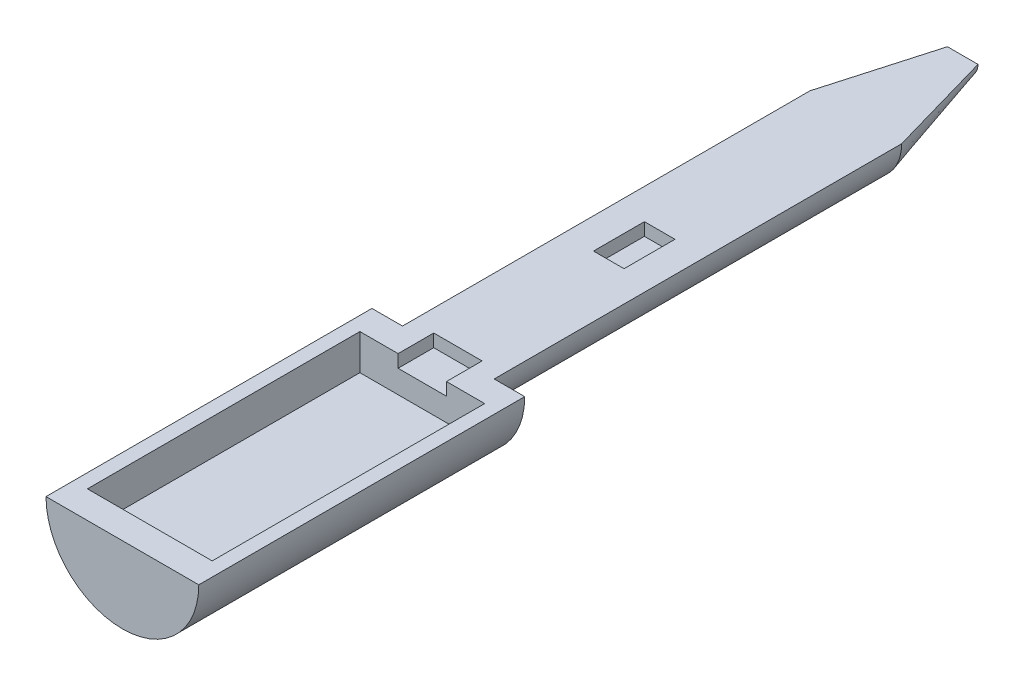
ISO-10303-21;
HEADER;
FILE_DESCRIPTION(('STEP AP214'),'2;1');
FILE_NAME('part.step','',(''),(''),'','','');
FILE_SCHEMA(('AUTOMOTIVE_DESIGN { 1 0 10303 214 1 1 1 1 }'));
ENDSEC;
DATA;
#1=APPLICATION_CONTEXT('core data for automotive mechanical design processes');
#2=APPLICATION_PROTOCOL_DEFINITION('international standard','automotive_design',2000,#1);
#3=PRODUCT_CONTEXT('',#1,'mechanical');
#4=PRODUCT('Part','Part','',(#3));
#5=PRODUCT_RELATED_PRODUCT_CATEGORY('part','',(#4));
#6=PRODUCT_DEFINITION_FORMATION('','',#4);
#7=PRODUCT_DEFINITION_CONTEXT('part definition',#1,'design');
#8=PRODUCT_DEFINITION('design','',#6,#7);
#9=PRODUCT_DEFINITION_SHAPE('','',#8);
#10=(LENGTH_UNIT() NAMED_UNIT(*) SI_UNIT(.MILLI.,.METRE.));
#11=(NAMED_UNIT(*) PLANE_ANGLE_UNIT() SI_UNIT($,.RADIAN.));
#12=(NAMED_UNIT(*) SI_UNIT($,.STERADIAN.) SOLID_ANGLE_UNIT());
#13=UNCERTAINTY_MEASURE_WITH_UNIT(LENGTH_MEASURE(1.E-05),#10,'distance_accuracy_value','');
#14=(GEOMETRIC_REPRESENTATION_CONTEXT(3) GLOBAL_UNCERTAINTY_ASSIGNED_CONTEXT((#13)) GLOBAL_UNIT_ASSIGNED_CONTEXT((#10,
#11,#12)) REPRESENTATION_CONTEXT('',''));
#15=CARTESIAN_POINT('',(0.,0.,0.));
#16=DIRECTION('',(0.,0.,1.));
#17=DIRECTION('',(1.,0.,0.));
#18=AXIS2_PLACEMENT_3D('',#15,#16,#17);
#19=CARTESIAN_POINT('',(0.,0.,0.));
#20=DIRECTION('',(0.,0.,1.));
#21=DIRECTION('',(1.,0.,0.));
#22=AXIS2_PLACEMENT_3D('',#19,#20,#21);
#23=PLANE('',#22);
#24=CARTESIAN_POINT('',(0.,0.,0.));
#25=DIRECTION('',(0.,0.,-1.));
#26=DIRECTION('',(-1.,0.,0.));
#27=AXIS2_PLACEMENT_3D('',#24,#25,#26);
#28=CIRCLE('',#27,15.);
#29=CARTESIAN_POINT('',(15.,1.04744440165294E-13,0.));
#30=VERTEX_POINT('',#29);
#31=CARTESIAN_POINT('',(-15.,0.,0.));
#32=VERTEX_POINT('',#31);
#33=EDGE_CURVE('E11',#30,#32,#28,.T.);
#34=ORIENTED_EDGE('',*,*,#33,.F.);
#35=DIRECTION('',(-1.,0.,0.));
#36=VECTOR('',#35,1.);
#37=CARTESIAN_POINT('',(0.,0.,0.));
#38=LINE('',#37,#36);
#39=EDGE_CURVE('E331',#30,#32,#38,.T.);
#40=ORIENTED_EDGE('',*,*,#39,.T.);
#41=EDGE_LOOP('',(#34,#40));
#42=FACE_BOUND('',#41,.T.);
#43=ADVANCED_FACE('F42',(#42),#23,.T.);
#44=CARTESIAN_POINT('',(0.,0.,-165.));
#45=DIRECTION('',(0.,0.,-1.));
#46=DIRECTION('',(-1.,0.,0.));
#47=AXIS2_PLACEMENT_3D('',#44,#45,#46);
#48=CYLINDRICAL_SURFACE('',#47,15.);
#49=CARTESIAN_POINT('',(0.,0.,-64.));
#50=DIRECTION('',(0.,0.,-1.));
#51=DIRECTION('',(-1.,0.,0.));
#52=AXIS2_PLACEMENT_3D('',#49,#50,#51);
#53=CIRCLE('',#52,15.);
#54=CARTESIAN_POINT('',(15.,1.04744440165294E-13,-64.));
#55=VERTEX_POINT('',#54);
#56=CARTESIAN_POINT('',(-15.,0.,-64.));
#57=VERTEX_POINT('',#56);
#58=EDGE_CURVE('E50',#55,#57,#53,.T.);
#59=ORIENTED_EDGE('',*,*,#58,.F.);
#60=DIRECTION('',(0.,0.,1.));
#61=VECTOR('',#60,1.);
#62=CARTESIAN_POINT('',(15.,1.04744440165294E-13,0.));
#63=LINE('',#62,#61);
#64=EDGE_CURVE('E327',#55,#30,#63,.T.);
#65=ORIENTED_EDGE('',*,*,#64,.T.);
#66=ORIENTED_EDGE('',*,*,#33,.T.);
#67=DIRECTION('',(0.,0.,1.));
#68=VECTOR('',#67,1.);
#69=CARTESIAN_POINT('',(-15.,0.,0.));
#70=LINE('',#69,#68);
#71=EDGE_CURVE('E307',#57,#32,#70,.T.);
#72=ORIENTED_EDGE('',*,*,#71,.F.);
#73=EDGE_LOOP('',(#59,#65,#66,#72));
#74=FACE_BOUND('',#73,.T.);
#75=ADVANCED_FACE('F355',(#74),#48,.T.);
#76=CARTESIAN_POINT('',(15.,1.04744440165294E-13,-64.));
#77=DIRECTION('',(0.,0.,-1.));
#78=DIRECTION('',(-1.,0.,0.));
#79=AXIS2_PLACEMENT_3D('',#76,#77,#78);
#80=PLANE('',#79);
#81=CARTESIAN_POINT('',(0.,0.,-64.));
#82=DIRECTION('',(0.,0.,-1.));
#83=DIRECTION('',(-1.,0.,0.));
#84=AXIS2_PLACEMENT_3D('',#81,#82,#83);
#85=CIRCLE('',#84,8.99999999999999);
#86=CARTESIAN_POINT('',(8.99999999999999,0.,-64.));
#87=VERTEX_POINT('',#86);
#88=CARTESIAN_POINT('',(-8.99999999999999,0.,-64.));
#89=VERTEX_POINT('',#88);
#90=EDGE_CURVE('E341',#87,#89,#85,.T.);
#91=ORIENTED_EDGE('',*,*,#90,.F.);
#92=DIRECTION('',(1.,0.,0.));
#93=VECTOR('',#92,1.);
#94=CARTESIAN_POINT('',(15.,1.04744440165294E-13,-64.));
#95=LINE('',#94,#93);
#96=EDGE_CURVE('E323',#87,#55,#95,.T.);
#97=ORIENTED_EDGE('',*,*,#96,.T.);
#98=ORIENTED_EDGE('',*,*,#58,.T.);
#99=DIRECTION('',(-1.,0.,0.));
#100=VECTOR('',#99,1.);
#101=CARTESIAN_POINT('',(-15.,0.,-64.));
#102=LINE('',#101,#100);
#103=EDGE_CURVE('E303',#89,#57,#102,.T.);
#104=ORIENTED_EDGE('',*,*,#103,.F.);
#105=EDGE_LOOP('',(#91,#97,#98,#104));
#106=FACE_BOUND('',#105,.T.);
#107=ADVANCED_FACE('F346',(#106),#80,.T.);
#108=CARTESIAN_POINT('',(0.,0.,-165.));
#109=DIRECTION('',(0.,0.,-1.));
#110=DIRECTION('',(-1.,0.,0.));
#111=AXIS2_PLACEMENT_3D('',#108,#109,#110);
#112=CYLINDRICAL_SURFACE('',#111,8.99999999999999);
#113=CARTESIAN_POINT('',(0.,0.,-144.));
#114=DIRECTION('',(0.,0.,-1.));
#115=DIRECTION('',(-1.,0.,0.));
#116=AXIS2_PLACEMENT_3D('',#113,#114,#115);
#117=CIRCLE('',#116,8.99999999999999);
#118=CARTESIAN_POINT('',(8.99999999999999,0.,-144.));
#119=VERTEX_POINT('',#118);
#120=CARTESIAN_POINT('',(-8.99999999999999,0.,-144.));
#121=VERTEX_POINT('',#120);
#122=EDGE_CURVE('E338',#119,#121,#117,.T.);
#123=ORIENTED_EDGE('',*,*,#122,.F.);
#124=DIRECTION('',(0.,0.,1.));
#125=VECTOR('',#124,1.);
#126=CARTESIAN_POINT('',(8.99999999999999,0.,-64.));
#127=LINE('',#126,#125);
#128=EDGE_CURVE('E319',#119,#87,#127,.T.);
#129=ORIENTED_EDGE('',*,*,#128,.T.);
#130=ORIENTED_EDGE('',*,*,#90,.T.);
#131=DIRECTION('',(0.,0.,1.));
#132=VECTOR('',#131,1.);
#133=CARTESIAN_POINT('',(-8.99999999999999,0.,-64.));
#134=LINE('',#133,#132);
#135=EDGE_CURVE('E299',#121,#89,#134,.T.);
#136=ORIENTED_EDGE('',*,*,#135,.F.);
#137=EDGE_LOOP('',(#123,#129,#130,#136));
#138=FACE_BOUND('',#137,.T.);
#139=ADVANCED_FACE('F360',(#138),#112,.T.);
#140=CARTESIAN_POINT('',(0.,0.,-165.));
#141=DIRECTION('',(0.,0.,1.));
#142=DIRECTION('',(1.,0.,0.));
#143=AXIS2_PLACEMENT_3D('',#140,#141,#142);
#144=CONICAL_SURFACE('',#143,3.,0.278299659005111);
#145=CARTESIAN_POINT('',(0.,0.,-165.));
#146=DIRECTION('',(0.,0.,-1.));
#147=DIRECTION('',(-1.,0.,0.));
#148=AXIS2_PLACEMENT_3D('',#145,#146,#147);
#149=CIRCLE('',#148,3.);
#150=CARTESIAN_POINT('',(3.,0.,-165.));
#151=VERTEX_POINT('',#150);
#152=CARTESIAN_POINT('',(-3.,0.,-165.));
#153=VERTEX_POINT('',#152);
#154=EDGE_CURVE('E334',#151,#153,#149,.T.);
#155=ORIENTED_EDGE('',*,*,#154,.F.);
#156=DIRECTION('',(0.274721127897378,0.,0.961523947640823));
#157=VECTOR('',#156,1.);
#158=CARTESIAN_POINT('',(8.99999999999999,0.,-144.));
#159=LINE('',#158,#157);
#160=EDGE_CURVE('E315',#151,#119,#159,.T.);
#161=ORIENTED_EDGE('',*,*,#160,.T.);
#162=ORIENTED_EDGE('',*,*,#122,.T.);
#163=DIRECTION('',(-0.274721127897378,0.,0.961523947640823));
#164=VECTOR('',#163,1.);
#165=CARTESIAN_POINT('',(-8.99999999999999,0.,-144.));
#166=LINE('',#165,#164);
#167=EDGE_CURVE('E286',#153,#121,#166,.T.);
#168=ORIENTED_EDGE('',*,*,#167,.F.);
#169=EDGE_LOOP('',(#155,#161,#162,#168));
#170=FACE_BOUND('',#169,.T.);
#171=ADVANCED_FACE('F363',(#170),#144,.T.);
#172=CARTESIAN_POINT('',(3.,0.,-165.));
#173=DIRECTION('',(0.,0.,-1.));
#174=DIRECTION('',(-1.,0.,0.));
#175=AXIS2_PLACEMENT_3D('',#172,#173,#174);
#176=PLANE('',#175);
#177=DIRECTION('',(1.,0.,0.));
#178=VECTOR('',#177,1.);
#179=CARTESIAN_POINT('',(3.,0.,-165.));
#180=LINE('',#179,#178);
#181=EDGE_CURVE('E311',#153,#151,#180,.T.);
#182=ORIENTED_EDGE('',*,*,#181,.T.);
#183=ORIENTED_EDGE('',*,*,#154,.T.);
#184=EDGE_LOOP('',(#182,#183));
#185=FACE_BOUND('',#184,.T.);
#186=ADVANCED_FACE('F365',(#185),#176,.T.);
#187=CARTESIAN_POINT('',(0.,0.,0.));
#188=DIRECTION('',(0.,1.,0.));
#189=DIRECTION('',(0.,0.,-1.));
#190=AXIS2_PLACEMENT_3D('',#187,#188,#189);
#191=PLANE('',#190);
#192=DIRECTION('',(0.,0.,1.));
#193=VECTOR('',#192,1.);
#194=CARTESIAN_POINT('',(-3.,0.,-105.5));
#195=LINE('',#194,#193);
#196=CARTESIAN_POINT('',(-3.,0.,-105.5));
#197=VERTEX_POINT('',#196);
#198=CARTESIAN_POINT('',(-3.,0.,-95.5));
#199=VERTEX_POINT('',#198);
#200=EDGE_CURVE('E57',#197,#199,#195,.T.);
#201=ORIENTED_EDGE('',*,*,#200,.F.);
#202=DIRECTION('',(-1.,0.,0.));
#203=VECTOR('',#202,1.);
#204=CARTESIAN_POINT('',(-3.,0.,-105.5));
#205=LINE('',#204,#203);
#206=CARTESIAN_POINT('',(3.,0.,-105.5));
#207=VERTEX_POINT('',#206);
#208=EDGE_CURVE('E186',#207,#197,#205,.T.);
#209=ORIENTED_EDGE('',*,*,#208,.F.);
#210=DIRECTION('',(0.,0.,-1.));
#211=VECTOR('',#210,1.);
#212=CARTESIAN_POINT('',(3.,0.,-105.5));
#213=LINE('',#212,#211);
#214=CARTESIAN_POINT('',(3.,0.,-95.5));
#215=VERTEX_POINT('',#214);
#216=EDGE_CURVE('E190',#215,#207,#213,.T.);
#217=ORIENTED_EDGE('',*,*,#216,.F.);
#218=DIRECTION('',(1.,0.,0.));
#219=VECTOR('',#218,1.);
#220=CARTESIAN_POINT('',(-3.,0.,-95.5));
#221=LINE('',#220,#219);
#222=EDGE_CURVE('E199',#199,#215,#221,.T.);
#223=ORIENTED_EDGE('',*,*,#222,.F.);
#224=EDGE_LOOP('',(#201,#209,#217,#223));
#225=FACE_BOUND('',#224,.T.);
#226=DIRECTION('',(0.,0.,1.));
#227=VECTOR('',#226,1.);
#228=CARTESIAN_POINT('',(-4.75,0.,-58.8824675416096));
#229=LINE('',#228,#227);
#230=CARTESIAN_POINT('',(-4.75,0.,-65.8824675416096));
#231=VERTEX_POINT('',#230);
#232=CARTESIAN_POINT('',(-4.75,0.,-58.8824675416096));
#233=VERTEX_POINT('',#232);
#234=EDGE_CURVE('E218',#231,#233,#229,.T.);
#235=ORIENTED_EDGE('',*,*,#234,.F.);
#236=DIRECTION('',(-1.,0.,0.));
#237=VECTOR('',#236,1.);
#238=CARTESIAN_POINT('',(-4.75,0.,-65.8824675416096));
#239=LINE('',#238,#237);
#240=CARTESIAN_POINT('',(4.75,0.,-65.8824675416096));
#241=VERTEX_POINT('',#240);
#242=EDGE_CURVE('E231',#241,#231,#239,.T.);
#243=ORIENTED_EDGE('',*,*,#242,.F.);
#244=DIRECTION('',(0.,0.,-1.));
#245=VECTOR('',#244,1.);
#246=CARTESIAN_POINT('',(4.75,0.,-65.8824675416096));
#247=LINE('',#246,#245);
#248=CARTESIAN_POINT('',(4.75,0.,-58.8824675416096));
#249=VERTEX_POINT('',#248);
#250=EDGE_CURVE('E208',#249,#241,#247,.T.);
#251=ORIENTED_EDGE('',*,*,#250,.F.);
#252=DIRECTION('',(-1.,0.,0.));
#253=VECTOR('',#252,1.);
#254=CARTESIAN_POINT('',(12.25,0.,-58.8824675416096));
#255=LINE('',#254,#253);
#256=CARTESIAN_POINT('',(12.25,0.,-58.8824675416096));
#257=VERTEX_POINT('',#256);
#258=EDGE_CURVE('E255',#257,#249,#255,.T.);
#259=ORIENTED_EDGE('',*,*,#258,.F.);
#260=DIRECTION('',(0.,0.,-1.));
#261=VECTOR('',#260,1.);
#262=CARTESIAN_POINT('',(12.25,0.,-5.38246754160956));
#263=LINE('',#262,#261);
#264=CARTESIAN_POINT('',(12.25,0.,-5.38246754160956));
#265=VERTEX_POINT('',#264);
#266=EDGE_CURVE('E274',#265,#257,#263,.T.);
#267=ORIENTED_EDGE('',*,*,#266,.F.);
#268=DIRECTION('',(1.,0.,0.));
#269=VECTOR('',#268,1.);
#270=CARTESIAN_POINT('',(-12.25,0.,-5.38246754160956));
#271=LINE('',#270,#269);
#272=CARTESIAN_POINT('',(-12.25,0.,-5.38246754160956));
#273=VERTEX_POINT('',#272);
#274=EDGE_CURVE('E270',#273,#265,#271,.T.);
#275=ORIENTED_EDGE('',*,*,#274,.F.);
#276=DIRECTION('',(0.,0.,1.));
#277=VECTOR('',#276,1.);
#278=CARTESIAN_POINT('',(-12.25,0.,-58.8824675416096));
#279=LINE('',#278,#277);
#280=CARTESIAN_POINT('',(-12.25,0.,-58.8824675416096));
#281=VERTEX_POINT('',#280);
#282=EDGE_CURVE('E241',#281,#273,#279,.T.);
#283=ORIENTED_EDGE('',*,*,#282,.F.);
#284=EDGE_CURVE('E278',#233,#281,#255,.T.);
#285=ORIENTED_EDGE('',*,*,#284,.F.);
#286=EDGE_LOOP('',(#235,#243,#251,#259,#267,#275,#283,#285));
#287=FACE_BOUND('',#286,.T.);
#288=ORIENTED_EDGE('',*,*,#181,.F.);
#289=ORIENTED_EDGE('',*,*,#167,.T.);
#290=ORIENTED_EDGE('',*,*,#135,.T.);
#291=ORIENTED_EDGE('',*,*,#103,.T.);
#292=ORIENTED_EDGE('',*,*,#71,.T.);
#293=ORIENTED_EDGE('',*,*,#39,.F.);
#294=ORIENTED_EDGE('',*,*,#64,.F.);
#295=ORIENTED_EDGE('',*,*,#96,.F.);
#296=ORIENTED_EDGE('',*,*,#128,.F.);
#297=ORIENTED_EDGE('',*,*,#160,.F.);
#298=EDGE_LOOP('',(#288,#289,#290,#291,#292,#293,#294,#295,#296,#297));
#299=FACE_BOUND('',#298,.T.);
#300=ADVANCED_FACE('F352',(#225,#287,#299),#191,.T.);
#301=CARTESIAN_POINT('',(-12.25,-7.00000000000009,-58.8824675416096));
#302=DIRECTION('',(-1.,0.,0.));
#303=DIRECTION('',(0.,-1.,0.));
#304=AXIS2_PLACEMENT_3D('',#301,#302,#303);
#305=PLANE('',#304);
#306=ORIENTED_EDGE('',*,*,#282,.T.);
#307=DIRECTION('',(0.,1.,0.));
#308=VECTOR('',#307,1.);
#309=CARTESIAN_POINT('',(-12.25,-7.00000000000009,-5.38246754160956));
#310=LINE('',#309,#308);
#311=CARTESIAN_POINT('',(-12.25,-7.00000000000009,-5.38246754160956));
#312=VERTEX_POINT('',#311);
#313=EDGE_CURVE('E267',#312,#273,#310,.T.);
#314=ORIENTED_EDGE('',*,*,#313,.F.);
#315=DIRECTION('',(0.,0.,1.));
#316=VECTOR('',#315,1.);
#317=CARTESIAN_POINT('',(-12.25,-7.00000000000009,-58.8824675416096));
#318=LINE('',#317,#316);
#319=CARTESIAN_POINT('',(-12.25,-7.00000000000009,-58.8824675416096));
#320=VERTEX_POINT('',#319);
#321=EDGE_CURVE('E250',#320,#312,#318,.T.);
#322=ORIENTED_EDGE('',*,*,#321,.F.);
#323=DIRECTION('',(0.,1.,0.));
#324=VECTOR('',#323,1.);
#325=CARTESIAN_POINT('',(-12.25,-7.00000000000009,-58.8824675416096));
#326=LINE('',#325,#324);
#327=EDGE_CURVE('E282',#320,#281,#326,.T.);
#328=ORIENTED_EDGE('',*,*,#327,.T.);
#329=EDGE_LOOP('',(#306,#314,#322,#328));
#330=FACE_BOUND('',#329,.T.);
#331=ADVANCED_FACE('F372',(#330),#305,.F.);
#332=CARTESIAN_POINT('',(12.2500000000001,-6.99999999999991,-58.8824675416096));
#333=DIRECTION('',(0.,0.,-1.));
#334=DIRECTION('',(0.,1.,0.));
#335=AXIS2_PLACEMENT_3D('',#332,#333,#334);
#336=PLANE('',#335);
#337=DIRECTION('',(1.,0.,0.));
#338=VECTOR('',#337,1.);
#339=CARTESIAN_POINT('',(4.75000000000002,-2.49999999999997,-58.8824675416096));
#340=LINE('',#339,#338);
#341=CARTESIAN_POINT('',(-4.74999999999998,-2.50000000000003,-58.8824675416096));
#342=VERTEX_POINT('',#341);
#343=CARTESIAN_POINT('',(4.75000000000002,-2.49999999999997,-58.8824675416096));
#344=VERTEX_POINT('',#343);
#345=EDGE_CURVE('E214',#342,#344,#340,.T.);
#346=ORIENTED_EDGE('',*,*,#345,.F.);
#347=DIRECTION('',(0.,1.,0.));
#348=VECTOR('',#347,1.);
#349=CARTESIAN_POINT('',(-4.74999999999998,-2.50000000000003,-58.8824675416096));
#350=LINE('',#349,#348);
#351=EDGE_CURVE('E237',#342,#233,#350,.T.);
#352=ORIENTED_EDGE('',*,*,#351,.T.);
#353=ORIENTED_EDGE('',*,*,#284,.T.);
#354=ORIENTED_EDGE('',*,*,#327,.F.);
#355=DIRECTION('',(-1.,0.,0.));
#356=VECTOR('',#355,1.);
#357=CARTESIAN_POINT('',(12.2500000000001,-6.99999999999991,-58.8824675416096));
#358=LINE('',#357,#356);
#359=CARTESIAN_POINT('',(12.2500000000001,-6.99999999999991,-58.8824675416096));
#360=VERTEX_POINT('',#359);
#361=EDGE_CURVE('E263',#360,#320,#358,.T.);
#362=ORIENTED_EDGE('',*,*,#361,.F.);
#363=DIRECTION('',(0.,1.,0.));
#364=VECTOR('',#363,1.);
#365=CARTESIAN_POINT('',(12.2500000000001,-6.99999999999991,-58.8824675416096));
#366=LINE('',#365,#364);
#367=EDGE_CURVE('E287',#360,#257,#366,.T.);
#368=ORIENTED_EDGE('',*,*,#367,.T.);
#369=ORIENTED_EDGE('',*,*,#258,.T.);
#370=DIRECTION('',(0.,1.,0.));
#371=VECTOR('',#370,1.);
#372=CARTESIAN_POINT('',(4.75000000000002,-2.49999999999997,-58.8824675416096));
#373=LINE('',#372,#371);
#374=EDGE_CURVE('E227',#344,#249,#373,.T.);
#375=ORIENTED_EDGE('',*,*,#374,.F.);
#376=EDGE_LOOP('',(#346,#352,#353,#354,#362,#368,#369,#375));
#377=FACE_BOUND('',#376,.T.);
#378=ADVANCED_FACE('F410',(#377),#336,.F.);
#379=CARTESIAN_POINT('',(12.25,-6.99999999999991,-5.38246754160956));
#380=DIRECTION('',(1.,0.,0.));
#381=DIRECTION('',(0.,1.,0.));
#382=AXIS2_PLACEMENT_3D('',#379,#380,#381);
#383=PLANE('',#382);
#384=ORIENTED_EDGE('',*,*,#266,.T.);
#385=ORIENTED_EDGE('',*,*,#367,.F.);
#386=DIRECTION('',(0.,0.,-1.));
#387=VECTOR('',#386,1.);
#388=CARTESIAN_POINT('',(12.25,-6.99999999999991,-5.38246754160956));
#389=LINE('',#388,#387);
#390=CARTESIAN_POINT('',(12.25,-6.99999999999991,-5.38246754160956));
#391=VERTEX_POINT('',#390);
#392=EDGE_CURVE('E259',#391,#360,#389,.T.);
#393=ORIENTED_EDGE('',*,*,#392,.F.);
#394=DIRECTION('',(0.,1.,0.));
#395=VECTOR('',#394,1.);
#396=CARTESIAN_POINT('',(12.25,-6.99999999999991,-5.38246754160956));
#397=LINE('',#396,#395);
#398=EDGE_CURVE('E290',#391,#265,#397,.T.);
#399=ORIENTED_EDGE('',*,*,#398,.T.);
#400=EDGE_LOOP('',(#384,#385,#393,#399));
#401=FACE_BOUND('',#400,.T.);
#402=ADVANCED_FACE('F420',(#401),#383,.F.);
#403=CARTESIAN_POINT('',(-12.25,-7.00000000000009,-5.38246754160956));
#404=DIRECTION('',(0.,0.,1.));
#405=DIRECTION('',(0.,-1.,0.));
#406=AXIS2_PLACEMENT_3D('',#403,#404,#405);
#407=PLANE('',#406);
#408=ORIENTED_EDGE('',*,*,#274,.T.);
#409=ORIENTED_EDGE('',*,*,#398,.F.);
#410=DIRECTION('',(1.,0.,0.));
#411=VECTOR('',#410,1.);
#412=CARTESIAN_POINT('',(-12.25,-7.00000000000009,-5.38246754160956));
#413=LINE('',#412,#411);
#414=EDGE_CURVE('E254',#312,#391,#413,.T.);
#415=ORIENTED_EDGE('',*,*,#414,.F.);
#416=ORIENTED_EDGE('',*,*,#313,.T.);
#417=EDGE_LOOP('',(#408,#409,#415,#416));
#418=FACE_BOUND('',#417,.T.);
#419=ADVANCED_FACE('F425',(#418),#407,.F.);
#420=CARTESIAN_POINT('',(0.,-7.,0.));
#421=DIRECTION('',(0.,1.,0.));
#422=DIRECTION('',(-1.,0.,0.));
#423=AXIS2_PLACEMENT_3D('',#420,#421,#422);
#424=PLANE('',#423);
#425=ORIENTED_EDGE('',*,*,#321,.T.);
#426=ORIENTED_EDGE('',*,*,#414,.T.);
#427=ORIENTED_EDGE('',*,*,#392,.T.);
#428=ORIENTED_EDGE('',*,*,#361,.T.);
#429=EDGE_LOOP('',(#425,#426,#427,#428));
#430=FACE_BOUND('',#429,.T.);
#431=ADVANCED_FACE('F436',(#430),#424,.T.);
#432=CARTESIAN_POINT('',(-4.74999999999998,-2.50000000000003,-58.8824675416096));
#433=DIRECTION('',(-1.,0.,0.));
#434=DIRECTION('',(0.,-1.,0.));
#435=AXIS2_PLACEMENT_3D('',#432,#433,#434);
#436=PLANE('',#435);
#437=ORIENTED_EDGE('',*,*,#234,.T.);
#438=ORIENTED_EDGE('',*,*,#351,.F.);
#439=DIRECTION('',(0.,0.,1.));
#440=VECTOR('',#439,1.);
#441=CARTESIAN_POINT('',(-4.74999999999998,-2.50000000000003,-58.8824675416096));
#442=LINE('',#441,#440);
#443=CARTESIAN_POINT('',(-4.74999999999998,-2.50000000000003,-65.8824675416096));
#444=VERTEX_POINT('',#443);
#445=EDGE_CURVE('E65',#444,#342,#442,.T.);
#446=ORIENTED_EDGE('',*,*,#445,.F.);
#447=DIRECTION('',(0.,1.,0.));
#448=VECTOR('',#447,1.);
#449=CARTESIAN_POINT('',(-4.74999999999998,-2.50000000000003,-65.8824675416096));
#450=LINE('',#449,#448);
#451=EDGE_CURVE('E242',#444,#231,#450,.T.);
#452=ORIENTED_EDGE('',*,*,#451,.T.);
#453=EDGE_LOOP('',(#437,#438,#446,#452));
#454=FACE_BOUND('',#453,.T.);
#455=ADVANCED_FACE('F447',(#454),#436,.F.);
#456=CARTESIAN_POINT('',(-4.74999999999998,-2.50000000000003,-65.8824675416096));
#457=DIRECTION('',(0.,0.,-1.));
#458=DIRECTION('',(-1.,0.,0.));
#459=AXIS2_PLACEMENT_3D('',#456,#457,#458);
#460=PLANE('',#459);
#461=ORIENTED_EDGE('',*,*,#242,.T.);
#462=ORIENTED_EDGE('',*,*,#451,.F.);
#463=DIRECTION('',(-1.,0.,0.));
#464=VECTOR('',#463,1.);
#465=CARTESIAN_POINT('',(-4.74999999999998,-2.50000000000003,-65.8824675416096));
#466=LINE('',#465,#464);
#467=CARTESIAN_POINT('',(4.75000000000002,-2.49999999999997,-65.8824675416096));
#468=VERTEX_POINT('',#467);
#469=EDGE_CURVE('E222',#468,#444,#466,.T.);
#470=ORIENTED_EDGE('',*,*,#469,.F.);
#471=DIRECTION('',(0.,1.,0.));
#472=VECTOR('',#471,1.);
#473=CARTESIAN_POINT('',(4.75000000000002,-2.49999999999997,-65.8824675416096));
#474=LINE('',#473,#472);
#475=EDGE_CURVE('E245',#468,#241,#474,.T.);
#476=ORIENTED_EDGE('',*,*,#475,.T.);
#477=EDGE_LOOP('',(#461,#462,#470,#476));
#478=FACE_BOUND('',#477,.T.);
#479=ADVANCED_FACE('F466',(#478),#460,.F.);
#480=CARTESIAN_POINT('',(4.75000000000002,-2.49999999999997,-65.8824675416096));
#481=DIRECTION('',(1.,0.,0.));
#482=DIRECTION('',(0.,1.,0.));
#483=AXIS2_PLACEMENT_3D('',#480,#481,#482);
#484=PLANE('',#483);
#485=ORIENTED_EDGE('',*,*,#250,.T.);
#486=ORIENTED_EDGE('',*,*,#475,.F.);
#487=DIRECTION('',(0.,0.,-1.));
#488=VECTOR('',#487,1.);
#489=CARTESIAN_POINT('',(4.75000000000002,-2.49999999999997,-65.8824675416096));
#490=LINE('',#489,#488);
#491=EDGE_CURVE('E217',#344,#468,#490,.T.);
#492=ORIENTED_EDGE('',*,*,#491,.F.);
#493=ORIENTED_EDGE('',*,*,#374,.T.);
#494=EDGE_LOOP('',(#485,#486,#492,#493));
#495=FACE_BOUND('',#494,.T.);
#496=ADVANCED_FACE('F477',(#495),#484,.F.);
#497=CARTESIAN_POINT('',(0.,-2.5,0.));
#498=DIRECTION('',(0.,-1.,0.));
#499=DIRECTION('',(1.,0.,0.));
#500=AXIS2_PLACEMENT_3D('',#497,#498,#499);
#501=PLANE('',#500);
#502=ORIENTED_EDGE('',*,*,#345,.T.);
#503=ORIENTED_EDGE('',*,*,#491,.T.);
#504=ORIENTED_EDGE('',*,*,#469,.T.);
#505=ORIENTED_EDGE('',*,*,#445,.T.);
#506=EDGE_LOOP('',(#502,#503,#504,#505));
#507=FACE_BOUND('',#506,.T.);
#508=ADVANCED_FACE('F488',(#507),#501,.F.);
#509=CARTESIAN_POINT('',(-2.99999999999998,-2.50000000000002,-105.5));
#510=DIRECTION('',(-1.,0.,0.));
#511=DIRECTION('',(0.,-1.,0.));
#512=AXIS2_PLACEMENT_3D('',#509,#510,#511);
#513=PLANE('',#512);
#514=ORIENTED_EDGE('',*,*,#200,.T.);
#515=DIRECTION('',(0.,1.,0.));
#516=VECTOR('',#515,1.);
#517=CARTESIAN_POINT('',(-2.99999999999998,-2.50000000000002,-95.5));
#518=LINE('',#517,#516);
#519=CARTESIAN_POINT('',(-2.99999999999998,-2.50000000000002,-95.5));
#520=VERTEX_POINT('',#519);
#521=EDGE_CURVE('E161',#520,#199,#518,.T.);
#522=ORIENTED_EDGE('',*,*,#521,.F.);
#523=DIRECTION('',(0.,0.,1.));
#524=VECTOR('',#523,1.);
#525=CARTESIAN_POINT('',(-2.99999999999998,-2.50000000000002,-105.5));
#526=LINE('',#525,#524);
#527=CARTESIAN_POINT('',(-2.99999999999998,-2.50000000000002,-105.5));
#528=VERTEX_POINT('',#527);
#529=EDGE_CURVE('E165',#528,#520,#526,.T.);
#530=ORIENTED_EDGE('',*,*,#529,.F.);
#531=DIRECTION('',(0.,1.,0.));
#532=VECTOR('',#531,1.);
#533=CARTESIAN_POINT('',(-2.99999999999998,-2.50000000000002,-105.5));
#534=LINE('',#533,#532);
#535=EDGE_CURVE('E205',#528,#197,#534,.T.);
#536=ORIENTED_EDGE('',*,*,#535,.T.);
#537=EDGE_LOOP('',(#514,#522,#530,#536));
#538=FACE_BOUND('',#537,.T.);
#539=ADVANCED_FACE('F163',(#538),#513,.F.);
#540=CARTESIAN_POINT('',(-2.99999999999998,-2.50000000000002,-105.5));
#541=DIRECTION('',(0.,0.,-1.));
#542=DIRECTION('',(0.,1.,0.));
#543=AXIS2_PLACEMENT_3D('',#540,#541,#542);
#544=PLANE('',#543);
#545=ORIENTED_EDGE('',*,*,#208,.T.);
#546=ORIENTED_EDGE('',*,*,#535,.F.);
#547=DIRECTION('',(-1.,0.,0.));
#548=VECTOR('',#547,1.);
#549=CARTESIAN_POINT('',(-2.99999999999998,-2.50000000000002,-105.5));
#550=LINE('',#549,#548);
#551=CARTESIAN_POINT('',(3.00000000000002,-2.49999999999998,-105.5));
#552=VERTEX_POINT('',#551);
#553=EDGE_CURVE('E172',#552,#528,#550,.T.);
#554=ORIENTED_EDGE('',*,*,#553,.F.);
#555=DIRECTION('',(0.,1.,0.));
#556=VECTOR('',#555,1.);
#557=CARTESIAN_POINT('',(3.00000000000002,-2.49999999999998,-105.5));
#558=LINE('',#557,#556);
#559=EDGE_CURVE('E209',#552,#207,#558,.T.);
#560=ORIENTED_EDGE('',*,*,#559,.T.);
#561=EDGE_LOOP('',(#545,#546,#554,#560));
#562=FACE_BOUND('',#561,.T.);
#563=ADVANCED_FACE('F513',(#562),#544,.F.);
#564=CARTESIAN_POINT('',(3.00000000000002,-2.49999999999998,-105.5));
#565=DIRECTION('',(1.,0.,0.));
#566=DIRECTION('',(0.,1.,0.));
#567=AXIS2_PLACEMENT_3D('',#564,#565,#566);
#568=PLANE('',#567);
#569=ORIENTED_EDGE('',*,*,#216,.T.);
#570=ORIENTED_EDGE('',*,*,#559,.F.);
#571=DIRECTION('',(0.,0.,-1.));
#572=VECTOR('',#571,1.);
#573=CARTESIAN_POINT('',(3.00000000000002,-2.49999999999998,-105.5));
#574=LINE('',#573,#572);
#575=CARTESIAN_POINT('',(3.00000000000002,-2.49999999999998,-95.5));
#576=VERTEX_POINT('',#575);
#577=EDGE_CURVE('E181',#576,#552,#574,.T.);
#578=ORIENTED_EDGE('',*,*,#577,.F.);
#579=DIRECTION('',(0.,1.,0.));
#580=VECTOR('',#579,1.);
#581=CARTESIAN_POINT('',(3.00000000000002,-2.49999999999998,-95.5));
#582=LINE('',#581,#580);
#583=EDGE_CURVE('E171',#576,#215,#582,.T.);
#584=ORIENTED_EDGE('',*,*,#583,.T.);
#585=EDGE_LOOP('',(#569,#570,#578,#584));
#586=FACE_BOUND('',#585,.T.);
#587=ADVANCED_FACE('F523',(#586),#568,.F.);
#588=CARTESIAN_POINT('',(-2.99999999999998,-2.50000000000002,-95.5));
#589=DIRECTION('',(0.,0.,1.));
#590=DIRECTION('',(0.,-1.,0.));
#591=AXIS2_PLACEMENT_3D('',#588,#589,#590);
#592=PLANE('',#591);
#593=ORIENTED_EDGE('',*,*,#222,.T.);
#594=ORIENTED_EDGE('',*,*,#583,.F.);
#595=DIRECTION('',(1.,0.,0.));
#596=VECTOR('',#595,1.);
#597=CARTESIAN_POINT('',(-2.99999999999998,-2.50000000000002,-95.5));
#598=LINE('',#597,#596);
#599=EDGE_CURVE('E175',#520,#576,#598,.T.);
#600=ORIENTED_EDGE('',*,*,#599,.F.);
#601=ORIENTED_EDGE('',*,*,#521,.T.);
#602=EDGE_LOOP('',(#593,#594,#600,#601));
#603=FACE_BOUND('',#602,.T.);
#604=ADVANCED_FACE('F176',(#603),#592,.F.);
#605=CARTESIAN_POINT('',(0.,-2.5,0.));
#606=DIRECTION('',(0.,1.,0.));
#607=DIRECTION('',(-1.,0.,0.));
#608=AXIS2_PLACEMENT_3D('',#605,#606,#607);
#609=PLANE('',#608);
#610=ORIENTED_EDGE('',*,*,#529,.T.);
#611=ORIENTED_EDGE('',*,*,#599,.T.);
#612=ORIENTED_EDGE('',*,*,#577,.T.);
#613=ORIENTED_EDGE('',*,*,#553,.T.);
#614=EDGE_LOOP('',(#610,#611,#612,#613));
#615=FACE_BOUND('',#614,.T.);
#616=ADVANCED_FACE('F183',(#615),#609,.T.);
#617=CLOSED_SHELL('',(#43,#75,#107,#139,#171,#186,#300,#331,#378,#402,#419,#431,#455,#479,#496,
#508,#539,#563,#587,#604,#616));
#618=MANIFOLD_SOLID_BREP('B2',#617);
#619=ADVANCED_BREP_SHAPE_REPRESENTATION('',(#18,#618),#14);
#620=SHAPE_DEFINITION_REPRESENTATION(#9,#619);
ENDSEC;
END-ISO-10303-21;
